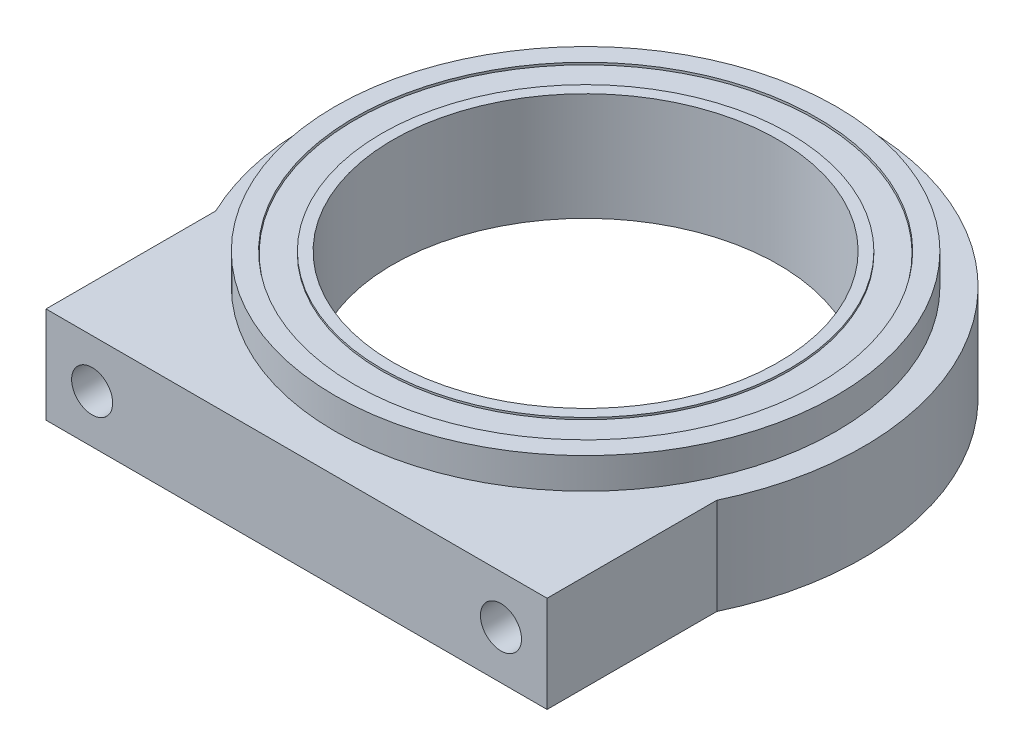
ISO-10303-21;
HEADER;
FILE_DESCRIPTION(('STEP AP214'),'2;1');
FILE_NAME('part.step','',(''),(''),'','','');
FILE_SCHEMA(('AUTOMOTIVE_DESIGN { 1 0 10303 214 1 1 1 1 }'));
ENDSEC;
DATA;
#1=APPLICATION_CONTEXT('core data for automotive mechanical design processes');
#2=APPLICATION_PROTOCOL_DEFINITION('international standard','automotive_design',2000,#1);
#3=PRODUCT_CONTEXT('',#1,'mechanical');
#4=PRODUCT('Part','Part','',(#3));
#5=PRODUCT_RELATED_PRODUCT_CATEGORY('part','',(#4));
#6=PRODUCT_DEFINITION_FORMATION('','',#4);
#7=PRODUCT_DEFINITION_CONTEXT('part definition',#1,'design');
#8=PRODUCT_DEFINITION('design','',#6,#7);
#9=PRODUCT_DEFINITION_SHAPE('','',#8);
#10=(LENGTH_UNIT() NAMED_UNIT(*) SI_UNIT(.MILLI.,.METRE.));
#11=(NAMED_UNIT(*) PLANE_ANGLE_UNIT() SI_UNIT($,.RADIAN.));
#12=(NAMED_UNIT(*) SI_UNIT($,.STERADIAN.) SOLID_ANGLE_UNIT());
#13=UNCERTAINTY_MEASURE_WITH_UNIT(LENGTH_MEASURE(1.E-05),#10,'distance_accuracy_value','');
#14=(GEOMETRIC_REPRESENTATION_CONTEXT(3) GLOBAL_UNCERTAINTY_ASSIGNED_CONTEXT((#13)) GLOBAL_UNIT_ASSIGNED_CONTEXT((#10,
#11,#12)) REPRESENTATION_CONTEXT('',''));
#15=CARTESIAN_POINT('',(0.,0.,0.));
#16=DIRECTION('',(0.,0.,1.));
#17=DIRECTION('',(1.,0.,0.));
#18=AXIS2_PLACEMENT_3D('',#15,#16,#17);
#19=CARTESIAN_POINT('',(0.,-1.778,0.));
#20=DIRECTION('',(0.,1.,0.));
#21=DIRECTION('',(0.,0.,1.));
#22=AXIS2_PLACEMENT_3D('',#19,#20,#21);
#23=CYLINDRICAL_SURFACE('',#22,15.2110596784604);
#24=CARTESIAN_POINT('',(0.,-1.778,0.));
#25=DIRECTION('',(0.,1.,0.));
#26=DIRECTION('',(0.,0.,1.));
#27=AXIS2_PLACEMENT_3D('',#24,#25,#26);
#28=CIRCLE('',#27,15.2110596784604);
#29=CARTESIAN_POINT('',(0.,-1.778,15.2110596784604));
#30=VERTEX_POINT('',#29);
#31=EDGE_CURVE('E11',#30,#30,#28,.T.);
#32=ORIENTED_EDGE('',*,*,#31,.T.);
#33=EDGE_LOOP('',(#32));
#34=FACE_BOUND('',#33,.T.);
#35=CARTESIAN_POINT('',(0.,5.08,0.));
#36=DIRECTION('',(0.,1.,0.));
#37=DIRECTION('',(0.,0.,1.));
#38=AXIS2_PLACEMENT_3D('',#35,#36,#37);
#39=CIRCLE('',#38,15.2110596784604);
#40=CARTESIAN_POINT('',(0.,5.08,15.2110596784604));
#41=VERTEX_POINT('',#40);
#42=EDGE_CURVE('E50',#41,#41,#39,.T.);
#43=ORIENTED_EDGE('',*,*,#42,.F.);
#44=EDGE_LOOP('',(#43));
#45=FACE_BOUND('',#44,.T.);
#46=ADVANCED_FACE('F44',(#34,#45),#23,.T.);
#47=CARTESIAN_POINT('',(0.,-1.778,0.));
#48=DIRECTION('',(0.,1.,0.));
#49=DIRECTION('',(0.,0.,1.));
#50=AXIS2_PLACEMENT_3D('',#47,#48,#49);
#51=PLANE('',#50);
#52=CARTESIAN_POINT('',(0.,-1.778,0.));
#53=DIRECTION('',(0.,1.,0.));
#54=DIRECTION('',(0.,0.,1.));
#55=AXIS2_PLACEMENT_3D('',#52,#53,#54);
#56=CIRCLE('',#55,13.4330596784604);
#57=CARTESIAN_POINT('',(0.,-1.778,13.4330596784604));
#58=VERTEX_POINT('',#57);
#59=EDGE_CURVE('E58',#58,#58,#56,.T.);
#60=ORIENTED_EDGE('',*,*,#59,.T.);
#61=EDGE_LOOP('',(#60));
#62=FACE_BOUND('',#61,.T.);
#63=ORIENTED_EDGE('',*,*,#31,.F.);
#64=EDGE_LOOP('',(#63));
#65=FACE_BOUND('',#64,.T.);
#66=ADVANCED_FACE('F105',(#62,#65),#51,.F.);
#67=CARTESIAN_POINT('',(0.,5.08,0.));
#68=DIRECTION('',(0.,1.,0.));
#69=DIRECTION('',(0.,0.,1.));
#70=AXIS2_PLACEMENT_3D('',#67,#68,#69);
#71=PLANE('',#70);
#72=ORIENTED_EDGE('',*,*,#42,.T.);
#73=EDGE_LOOP('',(#72));
#74=FACE_BOUND('',#73,.T.);
#75=CARTESIAN_POINT('',(0.,5.08,0.));
#76=DIRECTION('',(0.,1.,0.));
#77=DIRECTION('',(0.,0.,1.));
#78=AXIS2_PLACEMENT_3D('',#75,#76,#77);
#79=CIRCLE('',#78,13.4330596784604);
#80=CARTESIAN_POINT('',(0.,5.08,13.4330596784604));
#81=VERTEX_POINT('',#80);
#82=EDGE_CURVE('E54',#81,#81,#79,.T.);
#83=ORIENTED_EDGE('',*,*,#82,.F.);
#84=EDGE_LOOP('',(#83));
#85=FACE_BOUND('',#84,.T.);
#86=ADVANCED_FACE('F101',(#74,#85),#71,.T.);
#87=CARTESIAN_POINT('',(0.,-1.905,0.));
#88=DIRECTION('',(0.,1.,0.));
#89=DIRECTION('',(0.,0.,1.));
#90=AXIS2_PLACEMENT_3D('',#87,#88,#89);
#91=CYLINDRICAL_SURFACE('',#90,13.4330596784604);
#92=CARTESIAN_POINT('',(0.,-1.905,0.));
#93=DIRECTION('',(0.,1.,0.));
#94=DIRECTION('',(0.,0.,1.));
#95=AXIS2_PLACEMENT_3D('',#92,#93,#94);
#96=CIRCLE('',#95,13.4330596784604);
#97=CARTESIAN_POINT('',(0.,-1.905,13.4330596784604));
#98=VERTEX_POINT('',#97);
#99=EDGE_CURVE('E63',#98,#98,#96,.T.);
#100=ORIENTED_EDGE('',*,*,#99,.T.);
#101=EDGE_LOOP('',(#100));
#102=FACE_BOUND('',#101,.T.);
#103=ORIENTED_EDGE('',*,*,#59,.F.);
#104=EDGE_LOOP('',(#103));
#105=FACE_BOUND('',#104,.T.);
#106=ADVANCED_FACE('F93',(#102,#105),#91,.T.);
#107=ORIENTED_EDGE('',*,*,#82,.T.);
#108=EDGE_LOOP('',(#107));
#109=FACE_BOUND('',#108,.T.);
#110=CARTESIAN_POINT('',(0.,5.207,0.));
#111=DIRECTION('',(0.,1.,0.));
#112=DIRECTION('',(0.,0.,1.));
#113=AXIS2_PLACEMENT_3D('',#110,#111,#112);
#114=CIRCLE('',#113,13.4330596784604);
#115=CARTESIAN_POINT('',(0.,5.207,13.4330596784604));
#116=VERTEX_POINT('',#115);
#117=EDGE_CURVE('E64',#116,#116,#114,.T.);
#118=ORIENTED_EDGE('',*,*,#117,.F.);
#119=EDGE_LOOP('',(#118));
#120=FACE_BOUND('',#119,.T.);
#121=ADVANCED_FACE('F91',(#109,#120),#91,.T.);
#122=CARTESIAN_POINT('',(0.,-1.905,0.));
#123=DIRECTION('',(0.,1.,0.));
#124=DIRECTION('',(0.,0.,1.));
#125=AXIS2_PLACEMENT_3D('',#122,#123,#124);
#126=PLANE('',#125);
#127=CARTESIAN_POINT('',(0.,-1.905,0.));
#128=DIRECTION('',(0.,1.,0.));
#129=DIRECTION('',(0.,0.,1.));
#130=AXIS2_PLACEMENT_3D('',#127,#128,#129);
#131=CIRCLE('',#130,12.7);
#132=CARTESIAN_POINT('',(0.,-1.905,12.7));
#133=VERTEX_POINT('',#132);
#134=EDGE_CURVE('E67',#133,#133,#131,.T.);
#135=ORIENTED_EDGE('',*,*,#134,.T.);
#136=EDGE_LOOP('',(#135));
#137=FACE_BOUND('',#136,.T.);
#138=ORIENTED_EDGE('',*,*,#99,.F.);
#139=EDGE_LOOP('',(#138));
#140=FACE_BOUND('',#139,.T.);
#141=ADVANCED_FACE('F76',(#137,#140),#126,.F.);
#142=CARTESIAN_POINT('',(0.,5.207,0.));
#143=DIRECTION('',(0.,1.,0.));
#144=DIRECTION('',(0.,0.,1.));
#145=AXIS2_PLACEMENT_3D('',#142,#143,#144);
#146=PLANE('',#145);
#147=CARTESIAN_POINT('',(0.,5.207,0.));
#148=DIRECTION('',(0.,1.,0.));
#149=DIRECTION('',(0.,0.,1.));
#150=AXIS2_PLACEMENT_3D('',#147,#148,#149);
#151=CIRCLE('',#150,12.7);
#152=CARTESIAN_POINT('',(0.,5.207,12.7));
#153=VERTEX_POINT('',#152);
#154=EDGE_CURVE('E70',#153,#153,#151,.T.);
#155=ORIENTED_EDGE('',*,*,#154,.F.);
#156=EDGE_LOOP('',(#155));
#157=FACE_BOUND('',#156,.T.);
#158=ORIENTED_EDGE('',*,*,#117,.T.);
#159=EDGE_LOOP('',(#158));
#160=FACE_BOUND('',#159,.T.);
#161=ADVANCED_FACE('F82',(#157,#160),#146,.T.);
#162=CARTESIAN_POINT('',(0.,-1.905,0.));
#163=DIRECTION('',(0.,1.,0.));
#164=DIRECTION('',(0.,0.,1.));
#165=AXIS2_PLACEMENT_3D('',#162,#163,#164);
#166=CYLINDRICAL_SURFACE('',#165,12.7);
#167=ORIENTED_EDGE('',*,*,#134,.F.);
#168=EDGE_LOOP('',(#167));
#169=FACE_BOUND('',#168,.T.);
#170=ORIENTED_EDGE('',*,*,#154,.T.);
#171=EDGE_LOOP('',(#170));
#172=FACE_BOUND('',#171,.T.);
#173=ADVANCED_FACE('F79',(#169,#172),#166,.F.);
#174=CLOSED_SHELL('',(#46,#66,#86,#106,#121,#141,#161,#173));
#175=MANIFOLD_SOLID_BREP('B2',#174);
#176=CARTESIAN_POINT('',(0.,3.175,0.));
#177=DIRECTION('',(0.,-1.,0.));
#178=DIRECTION('',(0.,0.,-1.));
#179=AXIS2_PLACEMENT_3D('',#176,#177,#178);
#180=CYLINDRICAL_SURFACE('',#179,15.875);
#181=CARTESIAN_POINT('',(0.,-3.175,0.));
#182=DIRECTION('',(0.,1.,0.));
#183=DIRECTION('',(0.,0.,1.));
#184=AXIS2_PLACEMENT_3D('',#181,#182,#183);
#185=CIRCLE('',#184,15.875);
#186=CARTESIAN_POINT('',(0.,-3.175,15.875));
#187=VERTEX_POINT('',#186);
#188=EDGE_CURVE('E255',#187,#187,#185,.T.);
#189=ORIENTED_EDGE('',*,*,#188,.F.);
#190=EDGE_LOOP('',(#189));
#191=FACE_BOUND('',#190,.T.);
#192=CARTESIAN_POINT('',(0.,-1.905,0.));
#193=DIRECTION('',(0.,1.,0.));
#194=DIRECTION('',(0.,0.,1.));
#195=AXIS2_PLACEMENT_3D('',#192,#193,#194);
#196=CIRCLE('',#195,15.875);
#197=CARTESIAN_POINT('',(0.,-1.905,15.875));
#198=VERTEX_POINT('',#197);
#199=EDGE_CURVE('E249',#198,#198,#196,.T.);
#200=ORIENTED_EDGE('',*,*,#199,.T.);
#201=EDGE_LOOP('',(#200));
#202=FACE_BOUND('',#201,.T.);
#203=ADVANCED_FACE('F164',(#191,#202),#180,.F.);
#204=CARTESIAN_POINT('',(0.,3.175,0.));
#205=DIRECTION('',(0.,1.,0.));
#206=DIRECTION('',(0.,0.,1.));
#207=AXIS2_PLACEMENT_3D('',#204,#205,#206);
#208=PLANE('',#207);
#209=CARTESIAN_POINT('',(0.,3.175,0.));
#210=DIRECTION('',(0.,1.,0.));
#211=DIRECTION('',(0.,0.,1.));
#212=AXIS2_PLACEMENT_3D('',#209,#210,#211);
#213=CIRCLE('',#212,16.51);
#214=CARTESIAN_POINT('',(0.,3.175,16.51));
#215=VERTEX_POINT('',#214);
#216=EDGE_CURVE('E252',#215,#215,#213,.T.);
#217=ORIENTED_EDGE('',*,*,#216,.F.);
#218=EDGE_LOOP('',(#217));
#219=FACE_BOUND('',#218,.T.);
#220=DIRECTION('',(0.,0.,1.));
#221=VECTOR('',#220,1.);
#222=CARTESIAN_POINT('',(-16.51,3.175,19.05));
#223=LINE('',#222,#221);
#224=CARTESIAN_POINT('',(-16.51,3.175,7.86580218413862));
#225=VERTEX_POINT('',#224);
#226=CARTESIAN_POINT('',(-16.51,3.175,19.05));
#227=VERTEX_POINT('',#226);
#228=EDGE_CURVE('E259',#225,#227,#223,.T.);
#229=ORIENTED_EDGE('',*,*,#228,.T.);
#230=DIRECTION('',(1.,0.,0.));
#231=VECTOR('',#230,1.);
#232=CARTESIAN_POINT('',(-16.51,3.175,19.05));
#233=LINE('',#232,#231);
#234=CARTESIAN_POINT('',(16.51,3.175,19.05));
#235=VERTEX_POINT('',#234);
#236=EDGE_CURVE('E212',#227,#235,#233,.T.);
#237=ORIENTED_EDGE('',*,*,#236,.T.);
#238=DIRECTION('',(0.,0.,-1.));
#239=VECTOR('',#238,1.);
#240=CARTESIAN_POINT('',(16.51,3.175,19.05));
#241=LINE('',#240,#239);
#242=CARTESIAN_POINT('',(16.51,3.175,7.86580218413862));
#243=VERTEX_POINT('',#242);
#244=EDGE_CURVE('E262',#235,#243,#241,.T.);
#245=ORIENTED_EDGE('',*,*,#244,.T.);
#246=CARTESIAN_POINT('',(0.,3.175,0.));
#247=DIRECTION('',(0.,1.,0.));
#248=DIRECTION('',(0.,0.,1.));
#249=AXIS2_PLACEMENT_3D('',#246,#247,#248);
#250=CIRCLE('',#249,18.288);
#251=EDGE_CURVE('E181',#243,#225,#250,.T.);
#252=ORIENTED_EDGE('',*,*,#251,.T.);
#253=EDGE_LOOP('',(#229,#237,#245,#252));
#254=FACE_BOUND('',#253,.T.);
#255=ADVANCED_FACE('F298',(#219,#254),#208,.T.);
#256=CARTESIAN_POINT('',(0.,-3.175,0.));
#257=DIRECTION('',(0.,1.,0.));
#258=DIRECTION('',(0.,0.,1.));
#259=AXIS2_PLACEMENT_3D('',#256,#257,#258);
#260=PLANE('',#259);
#261=DIRECTION('',(0.,0.,1.));
#262=VECTOR('',#261,1.);
#263=CARTESIAN_POINT('',(-16.51,-3.175,19.05));
#264=LINE('',#263,#262);
#265=CARTESIAN_POINT('',(-16.51,-3.175,7.86580218413862));
#266=VERTEX_POINT('',#265);
#267=CARTESIAN_POINT('',(-16.51,-3.175,19.05));
#268=VERTEX_POINT('',#267);
#269=EDGE_CURVE('E258',#266,#268,#264,.T.);
#270=ORIENTED_EDGE('',*,*,#269,.F.);
#271=CARTESIAN_POINT('',(0.,-3.175,0.));
#272=DIRECTION('',(0.,1.,0.));
#273=DIRECTION('',(0.,0.,1.));
#274=AXIS2_PLACEMENT_3D('',#271,#272,#273);
#275=CIRCLE('',#274,18.288);
#276=CARTESIAN_POINT('',(16.51,-3.175,7.86580218413862));
#277=VERTEX_POINT('',#276);
#278=EDGE_CURVE('E205',#277,#266,#275,.T.);
#279=ORIENTED_EDGE('',*,*,#278,.F.);
#280=DIRECTION('',(0.,0.,-1.));
#281=VECTOR('',#280,1.);
#282=CARTESIAN_POINT('',(16.51,-3.175,19.05));
#283=LINE('',#282,#281);
#284=CARTESIAN_POINT('',(16.51,-3.175,19.05));
#285=VERTEX_POINT('',#284);
#286=EDGE_CURVE('E199',#285,#277,#283,.T.);
#287=ORIENTED_EDGE('',*,*,#286,.F.);
#288=DIRECTION('',(1.,0.,0.));
#289=VECTOR('',#288,1.);
#290=CARTESIAN_POINT('',(-16.51,-3.175,19.05));
#291=LINE('',#290,#289);
#292=EDGE_CURVE('E268',#268,#285,#291,.T.);
#293=ORIENTED_EDGE('',*,*,#292,.F.);
#294=EDGE_LOOP('',(#270,#279,#287,#293));
#295=FACE_BOUND('',#294,.T.);
#296=ORIENTED_EDGE('',*,*,#188,.T.);
#297=EDGE_LOOP('',(#296));
#298=FACE_BOUND('',#297,.T.);
#299=ADVANCED_FACE('F278',(#295,#298),#260,.F.);
#300=CARTESIAN_POINT('',(-16.51,3.175,19.05));
#301=DIRECTION('',(1.,0.,0.));
#302=DIRECTION('',(0.,0.,-1.));
#303=AXIS2_PLACEMENT_3D('',#300,#301,#302);
#304=PLANE('',#303);
#305=ORIENTED_EDGE('',*,*,#269,.T.);
#306=DIRECTION('',(0.,-1.,0.));
#307=VECTOR('',#306,1.);
#308=CARTESIAN_POINT('',(-16.51,3.175,19.05));
#309=LINE('',#308,#307);
#310=EDGE_CURVE('E42',#227,#268,#309,.T.);
#311=ORIENTED_EDGE('',*,*,#310,.F.);
#312=ORIENTED_EDGE('',*,*,#228,.F.);
#313=DIRECTION('',(0.,-1.,0.));
#314=VECTOR('',#313,1.);
#315=CARTESIAN_POINT('',(-16.51,3.175,7.86580218413862));
#316=LINE('',#315,#314);
#317=EDGE_CURVE('E265',#225,#266,#316,.T.);
#318=ORIENTED_EDGE('',*,*,#317,.T.);
#319=EDGE_LOOP('',(#305,#311,#312,#318));
#320=FACE_BOUND('',#319,.T.);
#321=ADVANCED_FACE('F166',(#320),#304,.F.);
#322=CARTESIAN_POINT('',(-16.51,3.175,19.05));
#323=DIRECTION('',(0.,0.,-1.));
#324=DIRECTION('',(-1.,0.,0.));
#325=AXIS2_PLACEMENT_3D('',#322,#323,#324);
#326=PLANE('',#325);
#327=CARTESIAN_POINT('',(13.4703841816039,1.99601619954581E-13,19.05));
#328=DIRECTION('',(0.,0.,1.));
#329=DIRECTION('',(1.,0.,0.));
#330=AXIS2_PLACEMENT_3D('',#327,#328,#329);
#331=CIRCLE('',#330,1.35255);
#332=CARTESIAN_POINT('',(14.8229341816039,1.99601619954581E-13,19.05));
#333=VERTEX_POINT('',#332);
#334=EDGE_CURVE('E230',#333,#333,#331,.T.);
#335=ORIENTED_EDGE('',*,*,#334,.F.);
#336=EDGE_LOOP('',(#335));
#337=FACE_BOUND('',#336,.T.);
#338=CARTESIAN_POINT('',(-13.4703841816037,0.,19.05));
#339=DIRECTION('',(0.,0.,1.));
#340=DIRECTION('',(1.,0.,0.));
#341=AXIS2_PLACEMENT_3D('',#338,#339,#340);
#342=CIRCLE('',#341,1.35255);
#343=CARTESIAN_POINT('',(-12.1178341816037,0.,19.05));
#344=VERTEX_POINT('',#343);
#345=EDGE_CURVE('E229',#344,#344,#342,.T.);
#346=ORIENTED_EDGE('',*,*,#345,.F.);
#347=EDGE_LOOP('',(#346));
#348=FACE_BOUND('',#347,.T.);
#349=ORIENTED_EDGE('',*,*,#292,.T.);
#350=DIRECTION('',(0.,-1.,0.));
#351=VECTOR('',#350,1.);
#352=CARTESIAN_POINT('',(16.51,3.175,19.05));
#353=LINE('',#352,#351);
#354=EDGE_CURVE('E173',#235,#285,#353,.T.);
#355=ORIENTED_EDGE('',*,*,#354,.F.);
#356=ORIENTED_EDGE('',*,*,#236,.F.);
#357=ORIENTED_EDGE('',*,*,#310,.T.);
#358=EDGE_LOOP('',(#349,#355,#356,#357));
#359=FACE_BOUND('',#358,.T.);
#360=ADVANCED_FACE('F294',(#337,#348,#359),#326,.F.);
#361=CARTESIAN_POINT('',(16.51,3.175,19.05));
#362=DIRECTION('',(-1.,0.,0.));
#363=DIRECTION('',(0.,0.,1.));
#364=AXIS2_PLACEMENT_3D('',#361,#362,#363);
#365=PLANE('',#364);
#366=ORIENTED_EDGE('',*,*,#286,.T.);
#367=DIRECTION('',(0.,-1.,0.));
#368=VECTOR('',#367,1.);
#369=CARTESIAN_POINT('',(16.51,3.175,7.86580218413862));
#370=LINE('',#369,#368);
#371=EDGE_CURVE('E273',#243,#277,#370,.T.);
#372=ORIENTED_EDGE('',*,*,#371,.F.);
#373=ORIENTED_EDGE('',*,*,#244,.F.);
#374=ORIENTED_EDGE('',*,*,#354,.T.);
#375=EDGE_LOOP('',(#366,#372,#373,#374));
#376=FACE_BOUND('',#375,.T.);
#377=ADVANCED_FACE('F275',(#376),#365,.F.);
#378=CARTESIAN_POINT('',(0.,3.175,0.));
#379=DIRECTION('',(0.,-1.,0.));
#380=DIRECTION('',(0.,0.,-1.));
#381=AXIS2_PLACEMENT_3D('',#378,#379,#380);
#382=CYLINDRICAL_SURFACE('',#381,18.288);
#383=ORIENTED_EDGE('',*,*,#278,.T.);
#384=ORIENTED_EDGE('',*,*,#317,.F.);
#385=ORIENTED_EDGE('',*,*,#251,.F.);
#386=ORIENTED_EDGE('',*,*,#371,.T.);
#387=EDGE_LOOP('',(#383,#384,#385,#386));
#388=FACE_BOUND('',#387,.T.);
#389=ADVANCED_FACE('F283',(#388),#382,.T.);
#390=CARTESIAN_POINT('',(0.,5.207,0.));
#391=DIRECTION('',(0.,1.,0.));
#392=DIRECTION('',(0.,0.,1.));
#393=AXIS2_PLACEMENT_3D('',#390,#391,#392);
#394=PLANE('',#393);
#395=CARTESIAN_POINT('',(0.,5.207,0.));
#396=DIRECTION('',(0.,1.,0.));
#397=DIRECTION('',(0.,0.,1.));
#398=AXIS2_PLACEMENT_3D('',#395,#396,#397);
#399=CIRCLE('',#398,16.51);
#400=CARTESIAN_POINT('',(0.,5.207,16.51));
#401=VERTEX_POINT('',#400);
#402=EDGE_CURVE('E244',#401,#401,#399,.T.);
#403=ORIENTED_EDGE('',*,*,#402,.T.);
#404=EDGE_LOOP('',(#403));
#405=FACE_BOUND('',#404,.T.);
#406=CARTESIAN_POINT('',(0.,5.207,0.));
#407=DIRECTION('',(0.,1.,0.));
#408=DIRECTION('',(0.,0.,1.));
#409=AXIS2_PLACEMENT_3D('',#406,#407,#408);
#410=CIRCLE('',#409,15.24);
#411=CARTESIAN_POINT('',(0.,5.207,15.24));
#412=VERTEX_POINT('',#411);
#413=EDGE_CURVE('E241',#412,#412,#410,.T.);
#414=ORIENTED_EDGE('',*,*,#413,.F.);
#415=EDGE_LOOP('',(#414));
#416=FACE_BOUND('',#415,.T.);
#417=ADVANCED_FACE('F285',(#405,#416),#394,.T.);
#418=CARTESIAN_POINT('',(0.,-1.905,0.));
#419=DIRECTION('',(0.,1.,0.));
#420=DIRECTION('',(0.,0.,1.));
#421=AXIS2_PLACEMENT_3D('',#418,#419,#420);
#422=PLANE('',#421);
#423=ORIENTED_EDGE('',*,*,#199,.F.);
#424=EDGE_LOOP('',(#423));
#425=FACE_BOUND('',#424,.T.);
#426=CARTESIAN_POINT('',(0.,-1.905,0.));
#427=DIRECTION('',(0.,1.,0.));
#428=DIRECTION('',(0.,0.,1.));
#429=AXIS2_PLACEMENT_3D('',#426,#427,#428);
#430=CIRCLE('',#429,15.24);
#431=CARTESIAN_POINT('',(0.,-1.905,15.24));
#432=VERTEX_POINT('',#431);
#433=EDGE_CURVE('E240',#432,#432,#430,.T.);
#434=ORIENTED_EDGE('',*,*,#433,.T.);
#435=EDGE_LOOP('',(#434));
#436=FACE_BOUND('',#435,.T.);
#437=ADVANCED_FACE('F291',(#425,#436),#422,.F.);
#438=CARTESIAN_POINT('',(0.,5.207,0.));
#439=DIRECTION('',(0.,-1.,0.));
#440=DIRECTION('',(0.,0.,-1.));
#441=AXIS2_PLACEMENT_3D('',#438,#439,#440);
#442=CYLINDRICAL_SURFACE('',#441,16.51);
#443=ORIENTED_EDGE('',*,*,#216,.T.);
#444=EDGE_LOOP('',(#443));
#445=FACE_BOUND('',#444,.T.);
#446=ORIENTED_EDGE('',*,*,#402,.F.);
#447=EDGE_LOOP('',(#446));
#448=FACE_BOUND('',#447,.T.);
#449=ADVANCED_FACE('F309',(#445,#448),#442,.T.);
#450=CARTESIAN_POINT('',(0.,5.207,0.));
#451=DIRECTION('',(0.,-1.,0.));
#452=DIRECTION('',(0.,0.,-1.));
#453=AXIS2_PLACEMENT_3D('',#450,#451,#452);
#454=CYLINDRICAL_SURFACE('',#453,15.24);
#455=ORIENTED_EDGE('',*,*,#413,.T.);
#456=EDGE_LOOP('',(#455));
#457=FACE_BOUND('',#456,.T.);
#458=ORIENTED_EDGE('',*,*,#433,.F.);
#459=EDGE_LOOP('',(#458));
#460=FACE_BOUND('',#459,.T.);
#461=ADVANCED_FACE('F332',(#457,#460),#454,.F.);
#462=CARTESIAN_POINT('',(-13.4703841816037,0.,12.7));
#463=DIRECTION('',(0.,0.,1.));
#464=DIRECTION('',(1.,0.,0.));
#465=AXIS2_PLACEMENT_3D('',#462,#463,#464);
#466=CONICAL_SURFACE('',#465,1.35255,1.02974425867665);
#467=CARTESIAN_POINT('',(-13.4703841816037,0.,11.8873059697343));
#468=VERTEX_POINT('',#467);
#469=VERTEX_LOOP('',#468);
#470=FACE_BOUND('',#469,.T.);
#471=CARTESIAN_POINT('',(-13.4703841816037,0.,12.7));
#472=DIRECTION('',(0.,0.,1.));
#473=DIRECTION('',(1.,0.,0.));
#474=AXIS2_PLACEMENT_3D('',#471,#472,#473);
#475=CIRCLE('',#474,1.35255);
#476=CARTESIAN_POINT('',(-12.1178341816037,0.,12.7));
#477=VERTEX_POINT('',#476);
#478=EDGE_CURVE('E233',#477,#477,#475,.T.);
#479=ORIENTED_EDGE('',*,*,#478,.T.);
#480=EDGE_LOOP('',(#479));
#481=FACE_BOUND('',#480,.T.);
#482=ADVANCED_FACE('F326',(#470,#481),#466,.F.);
#483=CARTESIAN_POINT('',(-13.4703841816037,0.,19.05));
#484=DIRECTION('',(0.,0.,1.));
#485=DIRECTION('',(1.,0.,0.));
#486=AXIS2_PLACEMENT_3D('',#483,#484,#485);
#487=CYLINDRICAL_SURFACE('',#486,1.35255);
#488=ORIENTED_EDGE('',*,*,#478,.F.);
#489=EDGE_LOOP('',(#488));
#490=FACE_BOUND('',#489,.T.);
#491=ORIENTED_EDGE('',*,*,#345,.T.);
#492=EDGE_LOOP('',(#491));
#493=FACE_BOUND('',#492,.T.);
#494=ADVANCED_FACE('F223',(#490,#493),#487,.F.);
#495=CARTESIAN_POINT('',(13.4703841816039,1.99601619954581E-13,12.7));
#496=DIRECTION('',(0.,0.,1.));
#497=DIRECTION('',(1.,0.,0.));
#498=AXIS2_PLACEMENT_3D('',#495,#496,#497);
#499=CONICAL_SURFACE('',#498,1.35255,1.02974425867665);
#500=CARTESIAN_POINT('',(13.4703841816039,1.99601619954581E-13,11.8873059697343));
#501=VERTEX_POINT('',#500);
#502=VERTEX_LOOP('',#501);
#503=FACE_BOUND('',#502,.T.);
#504=CARTESIAN_POINT('',(13.4703841816039,1.99601619954581E-13,12.7));
#505=DIRECTION('',(0.,0.,1.));
#506=DIRECTION('',(1.,0.,0.));
#507=AXIS2_PLACEMENT_3D('',#504,#505,#506);
#508=CIRCLE('',#507,1.35255);
#509=CARTESIAN_POINT('',(14.8229341816039,1.99601619954581E-13,12.7));
#510=VERTEX_POINT('',#509);
#511=EDGE_CURVE('E227',#510,#510,#508,.T.);
#512=ORIENTED_EDGE('',*,*,#511,.T.);
#513=EDGE_LOOP('',(#512));
#514=FACE_BOUND('',#513,.T.);
#515=ADVANCED_FACE('F219',(#503,#514),#499,.F.);
#516=CARTESIAN_POINT('',(13.4703841816039,1.99601619954581E-13,19.05));
#517=DIRECTION('',(0.,0.,1.));
#518=DIRECTION('',(1.,0.,0.));
#519=AXIS2_PLACEMENT_3D('',#516,#517,#518);
#520=CYLINDRICAL_SURFACE('',#519,1.35255);
#521=ORIENTED_EDGE('',*,*,#511,.F.);
#522=EDGE_LOOP('',(#521));
#523=FACE_BOUND('',#522,.T.);
#524=ORIENTED_EDGE('',*,*,#334,.T.);
#525=EDGE_LOOP('',(#524));
#526=FACE_BOUND('',#525,.T.);
#527=ADVANCED_FACE('F222',(#523,#526),#520,.F.);
#528=CLOSED_SHELL('',(#203,#255,#299,#321,#360,#377,#389,#417,#437,#449,#461,#482,#494,#515,#527));
#529=MANIFOLD_SOLID_BREP('B6',#528);
#530=ADVANCED_BREP_SHAPE_REPRESENTATION('',(#18,#175,#529),#14);
#531=SHAPE_DEFINITION_REPRESENTATION(#9,#530);
ENDSEC;
END-ISO-10303-21;
